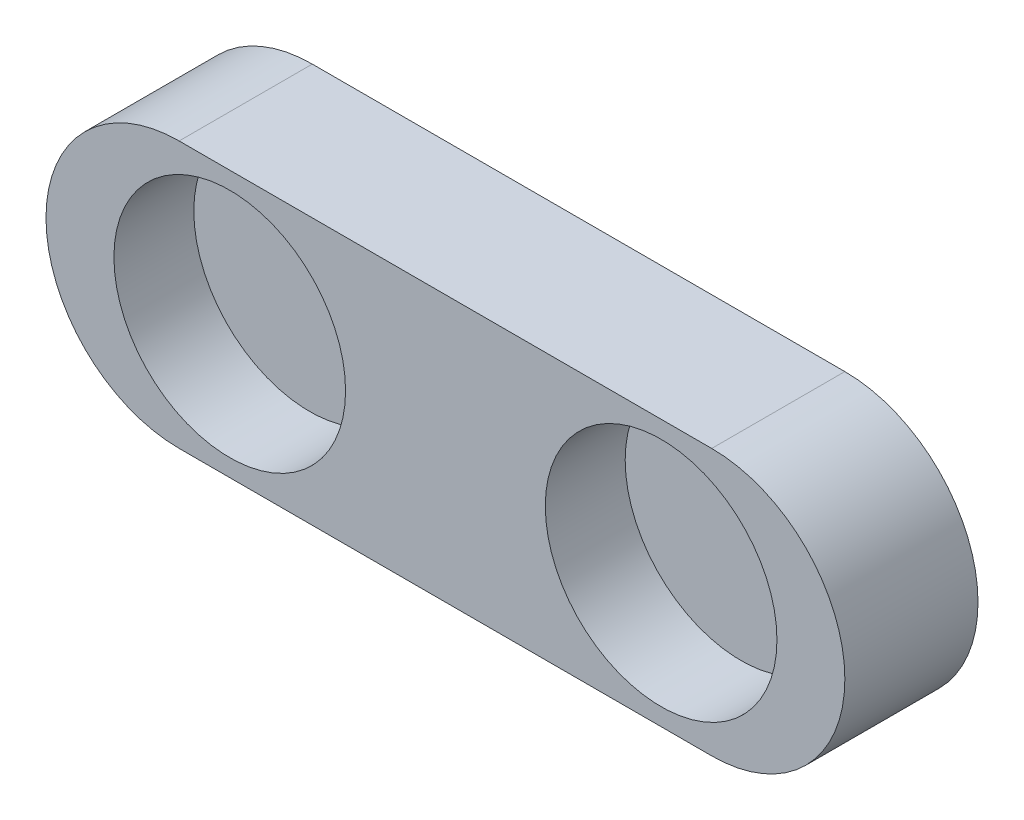
ISO-10303-21;
HEADER;
FILE_DESCRIPTION(('STEP AP214'),'2;1');
FILE_NAME('part.step','',(''),(''),'','','');
FILE_SCHEMA(('AUTOMOTIVE_DESIGN { 1 0 10303 214 1 1 1 1 }'));
ENDSEC;
DATA;
#1=APPLICATION_CONTEXT('core data for automotive mechanical design processes');
#2=APPLICATION_PROTOCOL_DEFINITION('international standard','automotive_design',2000,#1);
#3=PRODUCT_CONTEXT('',#1,'mechanical');
#4=PRODUCT('Part','Part','',(#3));
#5=PRODUCT_RELATED_PRODUCT_CATEGORY('part','',(#4));
#6=PRODUCT_DEFINITION_FORMATION('','',#4);
#7=PRODUCT_DEFINITION_CONTEXT('part definition',#1,'design');
#8=PRODUCT_DEFINITION('design','',#6,#7);
#9=PRODUCT_DEFINITION_SHAPE('','',#8);
#10=(LENGTH_UNIT() NAMED_UNIT(*) SI_UNIT(.MILLI.,.METRE.));
#11=(NAMED_UNIT(*) PLANE_ANGLE_UNIT() SI_UNIT($,.RADIAN.));
#12=(NAMED_UNIT(*) SI_UNIT($,.STERADIAN.) SOLID_ANGLE_UNIT());
#13=UNCERTAINTY_MEASURE_WITH_UNIT(LENGTH_MEASURE(1.E-05),#10,'distance_accuracy_value','');
#14=(GEOMETRIC_REPRESENTATION_CONTEXT(3) GLOBAL_UNCERTAINTY_ASSIGNED_CONTEXT((#13)) GLOBAL_UNIT_ASSIGNED_CONTEXT((#10,
#11,#12)) REPRESENTATION_CONTEXT('',''));
#15=CARTESIAN_POINT('',(0.,0.,0.));
#16=DIRECTION('',(0.,0.,1.));
#17=DIRECTION('',(1.,0.,0.));
#18=AXIS2_PLACEMENT_3D('',#15,#16,#17);
#19=CARTESIAN_POINT('',(0.,12.7,12.7));
#20=DIRECTION('',(0.,0.,-1.));
#21=DIRECTION('',(-1.,0.,0.));
#22=AXIS2_PLACEMENT_3D('',#19,#20,#21);
#23=CYLINDRICAL_SURFACE('',#22,12.7);
#24=CARTESIAN_POINT('',(0.,12.7,0.));
#25=DIRECTION('',(0.,0.,1.));
#26=DIRECTION('',(1.,0.,0.));
#27=AXIS2_PLACEMENT_3D('',#24,#25,#26);
#28=CIRCLE('',#27,12.7);
#29=CARTESIAN_POINT('',(0.,25.4,0.));
#30=VERTEX_POINT('',#29);
#31=CARTESIAN_POINT('',(0.,0.,0.));
#32=VERTEX_POINT('',#31);
#33=EDGE_CURVE('E96',#30,#32,#28,.T.);
#34=ORIENTED_EDGE('',*,*,#33,.T.);
#35=DIRECTION('',(0.,0.,-1.));
#36=VECTOR('',#35,1.);
#37=CARTESIAN_POINT('',(0.,0.,12.7));
#38=LINE('',#37,#36);
#39=CARTESIAN_POINT('',(0.,0.,12.7));
#40=VERTEX_POINT('',#39);
#41=EDGE_CURVE('E11',#40,#32,#38,.T.);
#42=ORIENTED_EDGE('',*,*,#41,.F.);
#43=CARTESIAN_POINT('',(0.,12.7,12.7));
#44=DIRECTION('',(0.,0.,1.));
#45=DIRECTION('',(1.,0.,0.));
#46=AXIS2_PLACEMENT_3D('',#43,#44,#45);
#47=CIRCLE('',#46,12.7);
#48=CARTESIAN_POINT('',(0.,25.4,12.7));
#49=VERTEX_POINT('',#48);
#50=EDGE_CURVE('E84',#49,#40,#47,.T.);
#51=ORIENTED_EDGE('',*,*,#50,.F.);
#52=DIRECTION('',(0.,0.,-1.));
#53=VECTOR('',#52,1.);
#54=CARTESIAN_POINT('',(0.,25.4,12.7));
#55=LINE('',#54,#53);
#56=EDGE_CURVE('E92',#49,#30,#55,.T.);
#57=ORIENTED_EDGE('',*,*,#56,.T.);
#58=EDGE_LOOP('',(#34,#42,#51,#57));
#59=FACE_BOUND('',#58,.T.);
#60=ADVANCED_FACE('F33',(#59),#23,.T.);
#61=CARTESIAN_POINT('',(0.,0.,12.7));
#62=DIRECTION('',(0.,1.,0.));
#63=DIRECTION('',(0.,0.,1.));
#64=AXIS2_PLACEMENT_3D('',#61,#62,#63);
#65=PLANE('',#64);
#66=DIRECTION('',(1.,0.,0.));
#67=VECTOR('',#66,1.);
#68=CARTESIAN_POINT('',(0.,0.,0.));
#69=LINE('',#68,#67);
#70=CARTESIAN_POINT('',(50.8,0.,0.));
#71=VERTEX_POINT('',#70);
#72=EDGE_CURVE('E88',#32,#71,#69,.T.);
#73=ORIENTED_EDGE('',*,*,#72,.T.);
#74=DIRECTION('',(0.,0.,-1.));
#75=VECTOR('',#74,1.);
#76=CARTESIAN_POINT('',(50.8,0.,12.7));
#77=LINE('',#76,#75);
#78=CARTESIAN_POINT('',(50.8,0.,12.7));
#79=VERTEX_POINT('',#78);
#80=EDGE_CURVE('E41',#79,#71,#77,.T.);
#81=ORIENTED_EDGE('',*,*,#80,.F.);
#82=DIRECTION('',(1.,0.,0.));
#83=VECTOR('',#82,1.);
#84=CARTESIAN_POINT('',(0.,0.,12.7));
#85=LINE('',#84,#83);
#86=EDGE_CURVE('E79',#40,#79,#85,.T.);
#87=ORIENTED_EDGE('',*,*,#86,.F.);
#88=ORIENTED_EDGE('',*,*,#41,.T.);
#89=EDGE_LOOP('',(#73,#81,#87,#88));
#90=FACE_BOUND('',#89,.T.);
#91=ADVANCED_FACE('F87',(#90),#65,.F.);
#92=CARTESIAN_POINT('',(50.8,12.7,12.7));
#93=DIRECTION('',(0.,0.,-1.));
#94=DIRECTION('',(-1.,0.,0.));
#95=AXIS2_PLACEMENT_3D('',#92,#93,#94);
#96=CYLINDRICAL_SURFACE('',#95,12.7);
#97=CARTESIAN_POINT('',(50.8,12.7,0.));
#98=DIRECTION('',(0.,0.,1.));
#99=DIRECTION('',(1.,0.,0.));
#100=AXIS2_PLACEMENT_3D('',#97,#98,#99);
#101=CIRCLE('',#100,12.7);
#102=CARTESIAN_POINT('',(50.8,25.4,0.));
#103=VERTEX_POINT('',#102);
#104=EDGE_CURVE('E66',#71,#103,#101,.T.);
#105=ORIENTED_EDGE('',*,*,#104,.T.);
#106=DIRECTION('',(0.,0.,-1.));
#107=VECTOR('',#106,1.);
#108=CARTESIAN_POINT('',(50.8,25.4,12.7));
#109=LINE('',#108,#107);
#110=CARTESIAN_POINT('',(50.8,25.4,12.7));
#111=VERTEX_POINT('',#110);
#112=EDGE_CURVE('E89',#111,#103,#109,.T.);
#113=ORIENTED_EDGE('',*,*,#112,.F.);
#114=CARTESIAN_POINT('',(50.8,12.7,12.7));
#115=DIRECTION('',(0.,0.,1.));
#116=DIRECTION('',(1.,0.,0.));
#117=AXIS2_PLACEMENT_3D('',#114,#115,#116);
#118=CIRCLE('',#117,12.7);
#119=EDGE_CURVE('E82',#79,#111,#118,.T.);
#120=ORIENTED_EDGE('',*,*,#119,.F.);
#121=ORIENTED_EDGE('',*,*,#80,.T.);
#122=EDGE_LOOP('',(#105,#113,#120,#121));
#123=FACE_BOUND('',#122,.T.);
#124=ADVANCED_FACE('F90',(#123),#96,.T.);
#125=CARTESIAN_POINT('',(0.,25.4,12.7));
#126=DIRECTION('',(0.,-1.,0.));
#127=DIRECTION('',(1.,0.,0.));
#128=AXIS2_PLACEMENT_3D('',#125,#126,#127);
#129=PLANE('',#128);
#130=DIRECTION('',(-1.,0.,0.));
#131=VECTOR('',#130,1.);
#132=CARTESIAN_POINT('',(0.,25.4,0.));
#133=LINE('',#132,#131);
#134=EDGE_CURVE('E72',#103,#30,#133,.T.);
#135=ORIENTED_EDGE('',*,*,#134,.T.);
#136=ORIENTED_EDGE('',*,*,#56,.F.);
#137=DIRECTION('',(-1.,0.,0.));
#138=VECTOR('',#137,1.);
#139=CARTESIAN_POINT('',(0.,25.4,12.7));
#140=LINE('',#139,#138);
#141=EDGE_CURVE('E49',#111,#49,#140,.T.);
#142=ORIENTED_EDGE('',*,*,#141,.F.);
#143=ORIENTED_EDGE('',*,*,#112,.T.);
#144=EDGE_LOOP('',(#135,#136,#142,#143));
#145=FACE_BOUND('',#144,.T.);
#146=ADVANCED_FACE('F104',(#145),#129,.F.);
#147=CARTESIAN_POINT('',(0.,12.7,12.7));
#148=DIRECTION('',(0.,0.,1.));
#149=DIRECTION('',(1.,0.,0.));
#150=AXIS2_PLACEMENT_3D('',#147,#148,#149);
#151=PLANE('',#150);
#152=CARTESIAN_POINT('',(4.826,12.7,12.7));
#153=DIRECTION('',(0.,0.,1.));
#154=DIRECTION('',(1.,0.,0.));
#155=AXIS2_PLACEMENT_3D('',#152,#153,#154);
#156=CIRCLE('',#155,11.049);
#157=CARTESIAN_POINT('',(15.875,12.7,12.7));
#158=VERTEX_POINT('',#157);
#159=EDGE_CURVE('E116',#158,#158,#156,.T.);
#160=ORIENTED_EDGE('',*,*,#159,.F.);
#161=EDGE_LOOP('',(#160));
#162=FACE_BOUND('',#161,.T.);
#163=CARTESIAN_POINT('',(45.974,12.7,12.7));
#164=DIRECTION('',(0.,0.,1.));
#165=DIRECTION('',(1.,0.,0.));
#166=AXIS2_PLACEMENT_3D('',#163,#164,#165);
#167=CIRCLE('',#166,11.049);
#168=CARTESIAN_POINT('',(57.023,12.7,12.7));
#169=VERTEX_POINT('',#168);
#170=EDGE_CURVE('E110',#169,#169,#167,.T.);
#171=ORIENTED_EDGE('',*,*,#170,.F.);
#172=EDGE_LOOP('',(#171));
#173=FACE_BOUND('',#172,.T.);
#174=ORIENTED_EDGE('',*,*,#50,.T.);
#175=ORIENTED_EDGE('',*,*,#86,.T.);
#176=ORIENTED_EDGE('',*,*,#119,.T.);
#177=ORIENTED_EDGE('',*,*,#141,.T.);
#178=EDGE_LOOP('',(#174,#175,#176,#177));
#179=FACE_BOUND('',#178,.T.);
#180=ADVANCED_FACE('F80',(#162,#173,#179),#151,.T.);
#181=CARTESIAN_POINT('',(0.,12.7,0.));
#182=DIRECTION('',(0.,0.,1.));
#183=DIRECTION('',(1.,0.,0.));
#184=AXIS2_PLACEMENT_3D('',#181,#182,#183);
#185=PLANE('',#184);
#186=ORIENTED_EDGE('',*,*,#33,.F.);
#187=ORIENTED_EDGE('',*,*,#134,.F.);
#188=ORIENTED_EDGE('',*,*,#104,.F.);
#189=ORIENTED_EDGE('',*,*,#72,.F.);
#190=EDGE_LOOP('',(#186,#187,#188,#189));
#191=FACE_BOUND('',#190,.T.);
#192=ADVANCED_FACE('F107',(#191),#185,.F.);
#193=CARTESIAN_POINT('',(45.974,12.7,5.08));
#194=DIRECTION('',(0.,0.,1.));
#195=DIRECTION('',(1.,0.,0.));
#196=AXIS2_PLACEMENT_3D('',#193,#194,#195);
#197=CYLINDRICAL_SURFACE('',#196,11.049);
#198=CARTESIAN_POINT('',(45.974,12.7,5.08));
#199=DIRECTION('',(0.,0.,1.));
#200=DIRECTION('',(1.,0.,0.));
#201=AXIS2_PLACEMENT_3D('',#198,#199,#200);
#202=CIRCLE('',#201,11.049);
#203=CARTESIAN_POINT('',(57.023,12.7,5.08));
#204=VERTEX_POINT('',#203);
#205=EDGE_CURVE('E113',#204,#204,#202,.T.);
#206=ORIENTED_EDGE('',*,*,#205,.F.);
#207=EDGE_LOOP('',(#206));
#208=FACE_BOUND('',#207,.T.);
#209=ORIENTED_EDGE('',*,*,#170,.T.);
#210=EDGE_LOOP('',(#209));
#211=FACE_BOUND('',#210,.T.);
#212=ADVANCED_FACE('F136',(#208,#211),#197,.F.);
#213=CARTESIAN_POINT('',(45.974,12.7,5.08));
#214=DIRECTION('',(0.,0.,1.));
#215=DIRECTION('',(1.,0.,0.));
#216=AXIS2_PLACEMENT_3D('',#213,#214,#215);
#217=PLANE('',#216);
#218=ORIENTED_EDGE('',*,*,#205,.T.);
#219=EDGE_LOOP('',(#218));
#220=FACE_BOUND('',#219,.T.);
#221=ADVANCED_FACE('F127',(#220),#217,.T.);
#222=CARTESIAN_POINT('',(4.826,12.7,5.08));
#223=DIRECTION('',(0.,0.,1.));
#224=DIRECTION('',(1.,0.,0.));
#225=AXIS2_PLACEMENT_3D('',#222,#223,#224);
#226=CYLINDRICAL_SURFACE('',#225,11.049);
#227=CARTESIAN_POINT('',(4.826,12.7,5.08));
#228=DIRECTION('',(0.,0.,1.));
#229=DIRECTION('',(1.,0.,0.));
#230=AXIS2_PLACEMENT_3D('',#227,#228,#229);
#231=CIRCLE('',#230,11.049);
#232=CARTESIAN_POINT('',(15.875,12.7,5.08));
#233=VERTEX_POINT('',#232);
#234=EDGE_CURVE('E99',#233,#233,#231,.T.);
#235=ORIENTED_EDGE('',*,*,#234,.F.);
#236=EDGE_LOOP('',(#235));
#237=FACE_BOUND('',#236,.T.);
#238=ORIENTED_EDGE('',*,*,#159,.T.);
#239=EDGE_LOOP('',(#238));
#240=FACE_BOUND('',#239,.T.);
#241=ADVANCED_FACE('F124',(#237,#240),#226,.F.);
#242=CARTESIAN_POINT('',(4.826,12.7,5.08));
#243=DIRECTION('',(0.,0.,1.));
#244=DIRECTION('',(1.,0.,0.));
#245=AXIS2_PLACEMENT_3D('',#242,#243,#244);
#246=PLANE('',#245);
#247=ORIENTED_EDGE('',*,*,#234,.T.);
#248=EDGE_LOOP('',(#247));
#249=FACE_BOUND('',#248,.T.);
#250=ADVANCED_FACE('F122',(#249),#246,.T.);
#251=CLOSED_SHELL('',(#60,#91,#124,#146,#180,#192,#212,#221,#241,#250));
#252=MANIFOLD_SOLID_BREP('B2',#251);
#253=ADVANCED_BREP_SHAPE_REPRESENTATION('',(#18,#252),#14);
#254=SHAPE_DEFINITION_REPRESENTATION(#9,#253);
ENDSEC;
END-ISO-10303-21;
